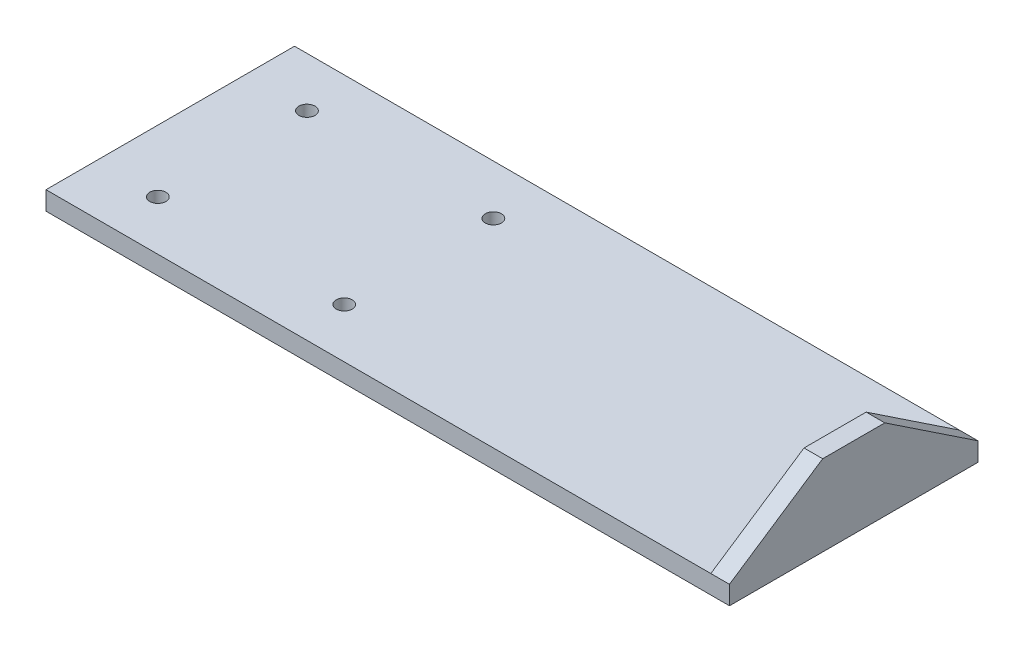
ISO-10303-21;
HEADER;
FILE_DESCRIPTION(('STEP AP214'),'2;1');
FILE_NAME('part.step','',(''),(''),'','','');
FILE_SCHEMA(('AUTOMOTIVE_DESIGN { 1 0 10303 214 1 1 1 1 }'));
ENDSEC;
DATA;
#1=APPLICATION_CONTEXT('core data for automotive mechanical design processes');
#2=APPLICATION_PROTOCOL_DEFINITION('international standard','automotive_design',2000,#1);
#3=PRODUCT_CONTEXT('',#1,'mechanical');
#4=PRODUCT('Part','Part','',(#3));
#5=PRODUCT_RELATED_PRODUCT_CATEGORY('part','',(#4));
#6=PRODUCT_DEFINITION_FORMATION('','',#4);
#7=PRODUCT_DEFINITION_CONTEXT('part definition',#1,'design');
#8=PRODUCT_DEFINITION('design','',#6,#7);
#9=PRODUCT_DEFINITION_SHAPE('','',#8);
#10=(LENGTH_UNIT() NAMED_UNIT(*) SI_UNIT(.MILLI.,.METRE.));
#11=(NAMED_UNIT(*) PLANE_ANGLE_UNIT() SI_UNIT($,.RADIAN.));
#12=(NAMED_UNIT(*) SI_UNIT($,.STERADIAN.) SOLID_ANGLE_UNIT());
#13=UNCERTAINTY_MEASURE_WITH_UNIT(LENGTH_MEASURE(1.E-05),#10,'distance_accuracy_value','');
#14=(GEOMETRIC_REPRESENTATION_CONTEXT(3) GLOBAL_UNCERTAINTY_ASSIGNED_CONTEXT((#13)) GLOBAL_UNIT_ASSIGNED_CONTEXT((#10,
#11,#12)) REPRESENTATION_CONTEXT('',''));
#15=CARTESIAN_POINT('',(0.,0.,0.));
#16=DIRECTION('',(0.,0.,1.));
#17=DIRECTION('',(1.,0.,0.));
#18=AXIS2_PLACEMENT_3D('',#15,#16,#17);
#19=CARTESIAN_POINT('',(0.,-15.,-100.));
#20=DIRECTION('',(0.,1.,0.));
#21=DIRECTION('',(0.,0.,1.));
#22=AXIS2_PLACEMENT_3D('',#19,#20,#21);
#23=PLANE('',#22);
#24=CARTESIAN_POINT('',(200.,-15.,60.));
#25=DIRECTION('',(0.,1.,0.));
#26=DIRECTION('',(0.,0.,1.));
#27=AXIS2_PLACEMENT_3D('',#24,#25,#26);
#28=CIRCLE('',#27,6.50000000000002);
#29=CARTESIAN_POINT('',(200.,-15.,66.5));
#30=VERTEX_POINT('',#29);
#31=EDGE_CURVE('E338',#30,#30,#28,.T.);
#32=ORIENTED_EDGE('',*,*,#31,.T.);
#33=EDGE_LOOP('',(#32));
#34=FACE_BOUND('',#33,.T.);
#35=CARTESIAN_POINT('',(50.,-15.,60.));
#36=DIRECTION('',(0.,1.,0.));
#37=DIRECTION('',(0.,0.,1.));
#38=AXIS2_PLACEMENT_3D('',#35,#36,#37);
#39=CIRCLE('',#38,6.5);
#40=CARTESIAN_POINT('',(50.,-15.,66.5));
#41=VERTEX_POINT('',#40);
#42=EDGE_CURVE('E346',#41,#41,#39,.T.);
#43=ORIENTED_EDGE('',*,*,#42,.T.);
#44=EDGE_LOOP('',(#43));
#45=FACE_BOUND('',#44,.T.);
#46=CARTESIAN_POINT('',(200.,-15.,-60.));
#47=DIRECTION('',(0.,1.,0.));
#48=DIRECTION('',(0.,0.,1.));
#49=AXIS2_PLACEMENT_3D('',#46,#47,#48);
#50=CIRCLE('',#49,6.50000000000002);
#51=CARTESIAN_POINT('',(200.,-15.,-53.5));
#52=VERTEX_POINT('',#51);
#53=EDGE_CURVE('E352',#52,#52,#50,.T.);
#54=ORIENTED_EDGE('',*,*,#53,.T.);
#55=EDGE_LOOP('',(#54));
#56=FACE_BOUND('',#55,.T.);
#57=CARTESIAN_POINT('',(50.,-15.,-60.));
#58=DIRECTION('',(0.,1.,0.));
#59=DIRECTION('',(0.,0.,1.));
#60=AXIS2_PLACEMENT_3D('',#57,#58,#59);
#61=CIRCLE('',#60,6.5);
#62=CARTESIAN_POINT('',(50.,-15.,-53.5));
#63=VERTEX_POINT('',#62);
#64=EDGE_CURVE('E123',#63,#63,#61,.T.);
#65=ORIENTED_EDGE('',*,*,#64,.T.);
#66=EDGE_LOOP('',(#65));
#67=FACE_BOUND('',#66,.T.);
#68=DIRECTION('',(-1.,0.,0.));
#69=VECTOR('',#68,1.);
#70=CARTESIAN_POINT('',(0.,-15.,-100.));
#71=LINE('',#70,#69);
#72=CARTESIAN_POINT('',(250.,-15.,-100.));
#73=VERTEX_POINT('',#72);
#74=CARTESIAN_POINT('',(0.,-15.,-100.));
#75=VERTEX_POINT('',#74);
#76=EDGE_CURVE('E183',#73,#75,#71,.T.);
#77=ORIENTED_EDGE('',*,*,#76,.F.);
#78=DIRECTION('',(0.,0.,1.));
#79=VECTOR('',#78,1.);
#80=CARTESIAN_POINT('',(250.,-15.,-100.));
#81=LINE('',#80,#79);
#82=CARTESIAN_POINT('',(250.,-15.,100.));
#83=VERTEX_POINT('',#82);
#84=EDGE_CURVE('E12',#73,#83,#81,.T.);
#85=ORIENTED_EDGE('',*,*,#84,.T.);
#86=DIRECTION('',(1.,0.,0.));
#87=VECTOR('',#86,1.);
#88=CARTESIAN_POINT('',(0.,-15.,100.));
#89=LINE('',#88,#87);
#90=CARTESIAN_POINT('',(0.,-15.,100.));
#91=VERTEX_POINT('',#90);
#92=EDGE_CURVE('E181',#91,#83,#89,.T.);
#93=ORIENTED_EDGE('',*,*,#92,.F.);
#94=DIRECTION('',(0.,0.,1.));
#95=VECTOR('',#94,1.);
#96=CARTESIAN_POINT('',(0.,-15.,-100.));
#97=LINE('',#96,#95);
#98=EDGE_CURVE('E178',#75,#91,#97,.T.);
#99=ORIENTED_EDGE('',*,*,#98,.F.);
#100=EDGE_LOOP('',(#77,#85,#93,#99));
#101=FACE_BOUND('',#100,.T.);
#102=ADVANCED_FACE('F33',(#34,#45,#56,#67,#101),#23,.F.);
#103=CARTESIAN_POINT('',(0.,-15.,-100.));
#104=DIRECTION('',(0.,0.,-1.));
#105=DIRECTION('',(-1.,0.,0.));
#106=AXIS2_PLACEMENT_3D('',#103,#104,#105);
#107=PLANE('',#106);
#108=DIRECTION('',(-1.,0.,0.));
#109=VECTOR('',#108,1.);
#110=CARTESIAN_POINT('',(0.,0.,-100.));
#111=LINE('',#110,#109);
#112=CARTESIAN_POINT('',(535.,0.,-100.));
#113=VERTEX_POINT('',#112);
#114=CARTESIAN_POINT('',(0.,0.,-100.));
#115=VERTEX_POINT('',#114);
#116=EDGE_CURVE('E152',#113,#115,#111,.T.);
#117=ORIENTED_EDGE('',*,*,#116,.F.);
#118=DIRECTION('',(1.,0.,0.));
#119=VECTOR('',#118,1.);
#120=CARTESIAN_POINT('',(-869.792066085148,0.,-100.));
#121=LINE('',#120,#119);
#122=CARTESIAN_POINT('',(550.,0.,-100.));
#123=VERTEX_POINT('',#122);
#124=EDGE_CURVE('E117',#113,#123,#121,.T.);
#125=ORIENTED_EDGE('',*,*,#124,.T.);
#126=DIRECTION('',(0.,1.,0.));
#127=VECTOR('',#126,1.);
#128=CARTESIAN_POINT('',(550.,-15.,-100.));
#129=LINE('',#128,#127);
#130=CARTESIAN_POINT('',(550.,-15.,-100.));
#131=VERTEX_POINT('',#130);
#132=EDGE_CURVE('E106',#131,#123,#129,.T.);
#133=ORIENTED_EDGE('',*,*,#132,.F.);
#134=EDGE_CURVE('E168',#131,#73,#71,.T.);
#135=ORIENTED_EDGE('',*,*,#134,.T.);
#136=ORIENTED_EDGE('',*,*,#76,.T.);
#137=DIRECTION('',(0.,1.,0.));
#138=VECTOR('',#137,1.);
#139=CARTESIAN_POINT('',(0.,-15.,-100.));
#140=LINE('',#139,#138);
#141=EDGE_CURVE('E156',#75,#115,#140,.T.);
#142=ORIENTED_EDGE('',*,*,#141,.T.);
#143=EDGE_LOOP('',(#117,#125,#133,#135,#136,#142));
#144=FACE_BOUND('',#143,.T.);
#145=ADVANCED_FACE('F185',(#144),#107,.T.);
#146=CARTESIAN_POINT('',(550.,-15.,-100.));
#147=DIRECTION('',(1.,0.,0.));
#148=DIRECTION('',(0.,0.,-1.));
#149=AXIS2_PLACEMENT_3D('',#146,#147,#148);
#150=PLANE('',#149);
#151=DIRECTION('',(0.,0.554700196225229,-0.832050294337844));
#152=VECTOR('',#151,1.);
#153=CARTESIAN_POINT('',(550.,87.6923076923077,-31.5384615384615));
#154=LINE('',#153,#152);
#155=CARTESIAN_POINT('',(550.,0.,100.));
#156=VERTEX_POINT('',#155);
#157=CARTESIAN_POINT('',(550.,50.,25.));
#158=VERTEX_POINT('',#157);
#159=EDGE_CURVE('E111',#156,#158,#154,.T.);
#160=ORIENTED_EDGE('',*,*,#159,.F.);
#161=DIRECTION('',(0.,1.,0.));
#162=VECTOR('',#161,1.);
#163=CARTESIAN_POINT('',(550.,-15.,100.));
#164=LINE('',#163,#162);
#165=CARTESIAN_POINT('',(550.,-15.,100.));
#166=VERTEX_POINT('',#165);
#167=EDGE_CURVE('E94',#166,#156,#164,.T.);
#168=ORIENTED_EDGE('',*,*,#167,.F.);
#169=DIRECTION('',(0.,0.,-1.));
#170=VECTOR('',#169,1.);
#171=CARTESIAN_POINT('',(550.,-15.,-100.));
#172=LINE('',#171,#170);
#173=EDGE_CURVE('E182',#166,#131,#172,.T.);
#174=ORIENTED_EDGE('',*,*,#173,.T.);
#175=ORIENTED_EDGE('',*,*,#132,.T.);
#176=DIRECTION('',(0.,0.554700196225229,0.832050294337844));
#177=VECTOR('',#176,1.);
#178=CARTESIAN_POINT('',(550.,-4.61538461538461,-106.923076923077));
#179=LINE('',#178,#177);
#180=CARTESIAN_POINT('',(550.,50.,-25.));
#181=VERTEX_POINT('',#180);
#182=EDGE_CURVE('E141',#123,#181,#179,.T.);
#183=ORIENTED_EDGE('',*,*,#182,.T.);
#184=DIRECTION('',(0.,0.,-1.));
#185=VECTOR('',#184,1.);
#186=CARTESIAN_POINT('',(550.,50.,-100.));
#187=LINE('',#186,#185);
#188=EDGE_CURVE('E114',#158,#181,#187,.T.);
#189=ORIENTED_EDGE('',*,*,#188,.F.);
#190=EDGE_LOOP('',(#160,#168,#174,#175,#183,#189));
#191=FACE_BOUND('',#190,.T.);
#192=ADVANCED_FACE('F112',(#191),#150,.T.);
#193=CARTESIAN_POINT('',(535.,50.,-100.));
#194=DIRECTION('',(1.,0.,0.));
#195=DIRECTION('',(0.,0.,-1.));
#196=AXIS2_PLACEMENT_3D('',#193,#194,#195);
#197=PLANE('',#196);
#198=DIRECTION('',(0.,0.,1.));
#199=VECTOR('',#198,1.);
#200=CARTESIAN_POINT('',(535.,0.,-100.));
#201=LINE('',#200,#199);
#202=CARTESIAN_POINT('',(535.,0.,100.));
#203=VERTEX_POINT('',#202);
#204=EDGE_CURVE('E145',#113,#203,#201,.T.);
#205=ORIENTED_EDGE('',*,*,#204,.T.);
#206=DIRECTION('',(0.,0.554700196225229,-0.832050294337844));
#207=VECTOR('',#206,1.);
#208=CARTESIAN_POINT('',(535.,107.692307692308,-61.5384615384615));
#209=LINE('',#208,#207);
#210=CARTESIAN_POINT('',(535.,50.,25.));
#211=VERTEX_POINT('',#210);
#212=EDGE_CURVE('E118',#203,#211,#209,.T.);
#213=ORIENTED_EDGE('',*,*,#212,.T.);
#214=DIRECTION('',(0.,0.,1.));
#215=VECTOR('',#214,1.);
#216=CARTESIAN_POINT('',(535.,50.,-100.));
#217=LINE('',#216,#215);
#218=CARTESIAN_POINT('',(535.,50.,-25.));
#219=VERTEX_POINT('',#218);
#220=EDGE_CURVE('E191',#219,#211,#217,.T.);
#221=ORIENTED_EDGE('',*,*,#220,.F.);
#222=DIRECTION('',(0.,0.554700196225229,0.832050294337844));
#223=VECTOR('',#222,1.);
#224=CARTESIAN_POINT('',(535.,15.3846153846154,-76.9230769230769));
#225=LINE('',#224,#223);
#226=EDGE_CURVE('E138',#113,#219,#225,.T.);
#227=ORIENTED_EDGE('',*,*,#226,.F.);
#228=EDGE_LOOP('',(#205,#213,#221,#227));
#229=FACE_BOUND('',#228,.T.);
#230=ADVANCED_FACE('F201',(#229),#197,.F.);
#231=CARTESIAN_POINT('',(550.,50.,-100.));
#232=DIRECTION('',(0.,-1.,0.));
#233=DIRECTION('',(0.,0.,-1.));
#234=AXIS2_PLACEMENT_3D('',#231,#232,#233);
#235=PLANE('',#234);
#236=ORIENTED_EDGE('',*,*,#220,.T.);
#237=DIRECTION('',(1.,0.,0.));
#238=VECTOR('',#237,1.);
#239=CARTESIAN_POINT('',(-219.792095274207,50.,25.));
#240=LINE('',#239,#238);
#241=EDGE_CURVE('E122',#211,#158,#240,.T.);
#242=ORIENTED_EDGE('',*,*,#241,.T.);
#243=ORIENTED_EDGE('',*,*,#188,.T.);
#244=DIRECTION('',(1.,0.,0.));
#245=VECTOR('',#244,1.);
#246=CARTESIAN_POINT('',(550.,50.,-25.));
#247=LINE('',#246,#245);
#248=EDGE_CURVE('E41',#219,#181,#247,.T.);
#249=ORIENTED_EDGE('',*,*,#248,.F.);
#250=EDGE_LOOP('',(#236,#242,#243,#249));
#251=FACE_BOUND('',#250,.T.);
#252=ADVANCED_FACE('F195',(#251),#235,.F.);
#253=CARTESIAN_POINT('',(0.,-15.,-100.));
#254=DIRECTION('',(-1.,0.,0.));
#255=DIRECTION('',(0.,0.,1.));
#256=AXIS2_PLACEMENT_3D('',#253,#254,#255);
#257=PLANE('',#256);
#258=DIRECTION('',(0.,0.,1.));
#259=VECTOR('',#258,1.);
#260=CARTESIAN_POINT('',(0.,0.,-100.));
#261=LINE('',#260,#259);
#262=CARTESIAN_POINT('',(0.,0.,100.));
#263=VERTEX_POINT('',#262);
#264=EDGE_CURVE('E173',#115,#263,#261,.T.);
#265=ORIENTED_EDGE('',*,*,#264,.F.);
#266=ORIENTED_EDGE('',*,*,#141,.F.);
#267=ORIENTED_EDGE('',*,*,#98,.T.);
#268=DIRECTION('',(0.,1.,0.));
#269=VECTOR('',#268,1.);
#270=CARTESIAN_POINT('',(0.,-15.,100.));
#271=LINE('',#270,#269);
#272=EDGE_CURVE('E107',#91,#263,#271,.T.);
#273=ORIENTED_EDGE('',*,*,#272,.T.);
#274=EDGE_LOOP('',(#265,#266,#267,#273));
#275=FACE_BOUND('',#274,.T.);
#276=ADVANCED_FACE('F35',(#275),#257,.T.);
#277=CARTESIAN_POINT('',(0.,-15.,100.));
#278=DIRECTION('',(0.,0.,1.));
#279=DIRECTION('',(1.,0.,0.));
#280=AXIS2_PLACEMENT_3D('',#277,#278,#279);
#281=PLANE('',#280);
#282=DIRECTION('',(1.,0.,0.));
#283=VECTOR('',#282,1.);
#284=CARTESIAN_POINT('',(-219.792095274207,0.,100.));
#285=LINE('',#284,#283);
#286=EDGE_CURVE('E99',#203,#156,#285,.T.);
#287=ORIENTED_EDGE('',*,*,#286,.F.);
#288=DIRECTION('',(1.,0.,0.));
#289=VECTOR('',#288,1.);
#290=CARTESIAN_POINT('',(0.,0.,100.));
#291=LINE('',#290,#289);
#292=EDGE_CURVE('E171',#263,#203,#291,.T.);
#293=ORIENTED_EDGE('',*,*,#292,.F.);
#294=ORIENTED_EDGE('',*,*,#272,.F.);
#295=ORIENTED_EDGE('',*,*,#92,.T.);
#296=EDGE_CURVE('E102',#83,#166,#89,.T.);
#297=ORIENTED_EDGE('',*,*,#296,.T.);
#298=ORIENTED_EDGE('',*,*,#167,.T.);
#299=EDGE_LOOP('',(#287,#293,#294,#295,#297,#298));
#300=FACE_BOUND('',#299,.T.);
#301=ADVANCED_FACE('F96',(#300),#281,.T.);
#302=ORIENTED_EDGE('',*,*,#84,.F.);
#303=ORIENTED_EDGE('',*,*,#134,.F.);
#304=ORIENTED_EDGE('',*,*,#173,.F.);
#305=ORIENTED_EDGE('',*,*,#296,.F.);
#306=EDGE_LOOP('',(#302,#303,#304,#305));
#307=FACE_BOUND('',#306,.T.);
#308=ADVANCED_FACE('F186',(#307),#23,.F.);
#309=CARTESIAN_POINT('',(0.,0.,-100.));
#310=DIRECTION('',(0.,1.,0.));
#311=DIRECTION('',(0.,0.,1.));
#312=AXIS2_PLACEMENT_3D('',#309,#310,#311);
#313=PLANE('',#312);
#314=CARTESIAN_POINT('',(200.,0.,60.));
#315=DIRECTION('',(0.,1.,0.));
#316=DIRECTION('',(0.,0.,1.));
#317=AXIS2_PLACEMENT_3D('',#314,#315,#316);
#318=CIRCLE('',#317,6.50000000000002);
#319=CARTESIAN_POINT('',(200.,0.,66.5));
#320=VERTEX_POINT('',#319);
#321=EDGE_CURVE('E341',#320,#320,#318,.T.);
#322=ORIENTED_EDGE('',*,*,#321,.F.);
#323=EDGE_LOOP('',(#322));
#324=FACE_BOUND('',#323,.T.);
#325=CARTESIAN_POINT('',(50.,0.,60.));
#326=DIRECTION('',(0.,1.,0.));
#327=DIRECTION('',(0.,0.,1.));
#328=AXIS2_PLACEMENT_3D('',#325,#326,#327);
#329=CIRCLE('',#328,6.5);
#330=CARTESIAN_POINT('',(50.,0.,66.5));
#331=VERTEX_POINT('',#330);
#332=EDGE_CURVE('E343',#331,#331,#329,.T.);
#333=ORIENTED_EDGE('',*,*,#332,.F.);
#334=EDGE_LOOP('',(#333));
#335=FACE_BOUND('',#334,.T.);
#336=CARTESIAN_POINT('',(200.,0.,-60.));
#337=DIRECTION('',(0.,1.,0.));
#338=DIRECTION('',(0.,0.,1.));
#339=AXIS2_PLACEMENT_3D('',#336,#337,#338);
#340=CIRCLE('',#339,6.50000000000002);
#341=CARTESIAN_POINT('',(200.,0.,-53.5));
#342=VERTEX_POINT('',#341);
#343=EDGE_CURVE('E349',#342,#342,#340,.T.);
#344=ORIENTED_EDGE('',*,*,#343,.F.);
#345=EDGE_LOOP('',(#344));
#346=FACE_BOUND('',#345,.T.);
#347=CARTESIAN_POINT('',(50.,0.,-60.));
#348=DIRECTION('',(0.,1.,0.));
#349=DIRECTION('',(0.,0.,1.));
#350=AXIS2_PLACEMENT_3D('',#347,#348,#349);
#351=CIRCLE('',#350,6.5);
#352=CARTESIAN_POINT('',(50.,0.,-53.5));
#353=VERTEX_POINT('',#352);
#354=EDGE_CURVE('E127',#353,#353,#351,.T.);
#355=ORIENTED_EDGE('',*,*,#354,.F.);
#356=EDGE_LOOP('',(#355));
#357=FACE_BOUND('',#356,.T.);
#358=ORIENTED_EDGE('',*,*,#204,.F.);
#359=ORIENTED_EDGE('',*,*,#116,.T.);
#360=ORIENTED_EDGE('',*,*,#264,.T.);
#361=ORIENTED_EDGE('',*,*,#292,.T.);
#362=EDGE_LOOP('',(#358,#359,#360,#361));
#363=FACE_BOUND('',#362,.T.);
#364=ADVANCED_FACE('F199',(#324,#335,#346,#357,#363),#313,.T.);
#365=CARTESIAN_POINT('',(-869.792066085148,0.,-100.));
#366=DIRECTION('',(0.,0.832050294337844,-0.554700196225229));
#367=DIRECTION('',(0.,0.554700196225229,0.832050294337844));
#368=AXIS2_PLACEMENT_3D('',#365,#366,#367);
#369=PLANE('',#368);
#370=ORIENTED_EDGE('',*,*,#182,.F.);
#371=ORIENTED_EDGE('',*,*,#124,.F.);
#372=ORIENTED_EDGE('',*,*,#226,.T.);
#373=ORIENTED_EDGE('',*,*,#248,.T.);
#374=EDGE_LOOP('',(#370,#371,#372,#373));
#375=FACE_BOUND('',#374,.T.);
#376=ADVANCED_FACE('F197',(#375),#369,.T.);
#377=CARTESIAN_POINT('',(-219.792095274207,0.,100.));
#378=DIRECTION('',(0.,-0.832050294337844,-0.554700196225229));
#379=DIRECTION('',(0.,0.554700196225229,-0.832050294337844));
#380=AXIS2_PLACEMENT_3D('',#377,#378,#379);
#381=PLANE('',#380);
#382=ORIENTED_EDGE('',*,*,#286,.T.);
#383=ORIENTED_EDGE('',*,*,#159,.T.);
#384=ORIENTED_EDGE('',*,*,#241,.F.);
#385=ORIENTED_EDGE('',*,*,#212,.F.);
#386=EDGE_LOOP('',(#382,#383,#384,#385));
#387=FACE_BOUND('',#386,.T.);
#388=ADVANCED_FACE('F121',(#387),#381,.F.);
#389=CARTESIAN_POINT('',(50.,-15.,-60.));
#390=DIRECTION('',(0.,1.,0.));
#391=DIRECTION('',(0.,0.,1.));
#392=AXIS2_PLACEMENT_3D('',#389,#390,#391);
#393=CYLINDRICAL_SURFACE('',#392,6.5);
#394=ORIENTED_EDGE('',*,*,#64,.F.);
#395=EDGE_LOOP('',(#394));
#396=FACE_BOUND('',#395,.T.);
#397=ORIENTED_EDGE('',*,*,#354,.T.);
#398=EDGE_LOOP('',(#397));
#399=FACE_BOUND('',#398,.T.);
#400=ADVANCED_FACE('F249',(#396,#399),#393,.F.);
#401=CARTESIAN_POINT('',(200.,-15.,-60.));
#402=DIRECTION('',(0.,1.,0.));
#403=DIRECTION('',(0.,0.,1.));
#404=AXIS2_PLACEMENT_3D('',#401,#402,#403);
#405=CYLINDRICAL_SURFACE('',#404,6.50000000000002);
#406=ORIENTED_EDGE('',*,*,#53,.F.);
#407=EDGE_LOOP('',(#406));
#408=FACE_BOUND('',#407,.T.);
#409=ORIENTED_EDGE('',*,*,#343,.T.);
#410=EDGE_LOOP('',(#409));
#411=FACE_BOUND('',#410,.T.);
#412=ADVANCED_FACE('F285',(#408,#411),#405,.F.);
#413=CARTESIAN_POINT('',(50.,-15.,60.));
#414=DIRECTION('',(0.,1.,0.));
#415=DIRECTION('',(0.,0.,1.));
#416=AXIS2_PLACEMENT_3D('',#413,#414,#415);
#417=CYLINDRICAL_SURFACE('',#416,6.5);
#418=ORIENTED_EDGE('',*,*,#42,.F.);
#419=EDGE_LOOP('',(#418));
#420=FACE_BOUND('',#419,.T.);
#421=ORIENTED_EDGE('',*,*,#332,.T.);
#422=EDGE_LOOP('',(#421));
#423=FACE_BOUND('',#422,.T.);
#424=ADVANCED_FACE('F295',(#420,#423),#417,.F.);
#425=CARTESIAN_POINT('',(200.,-15.,60.));
#426=DIRECTION('',(0.,1.,0.));
#427=DIRECTION('',(0.,0.,1.));
#428=AXIS2_PLACEMENT_3D('',#425,#426,#427);
#429=CYLINDRICAL_SURFACE('',#428,6.50000000000002);
#430=ORIENTED_EDGE('',*,*,#31,.F.);
#431=EDGE_LOOP('',(#430));
#432=FACE_BOUND('',#431,.T.);
#433=ORIENTED_EDGE('',*,*,#321,.T.);
#434=EDGE_LOOP('',(#433));
#435=FACE_BOUND('',#434,.T.);
#436=ADVANCED_FACE('F305',(#432,#435),#429,.F.);
#437=CLOSED_SHELL('',(#102,#145,#192,#230,#252,#276,#301,#308,#364,#376,#388,#400,#412,#424,#436));
#438=MANIFOLD_SOLID_BREP('B2',#437);
#439=ADVANCED_BREP_SHAPE_REPRESENTATION('',(#18,#438),#14);
#440=SHAPE_DEFINITION_REPRESENTATION(#9,#439);
ENDSEC;
END-ISO-10303-21;
